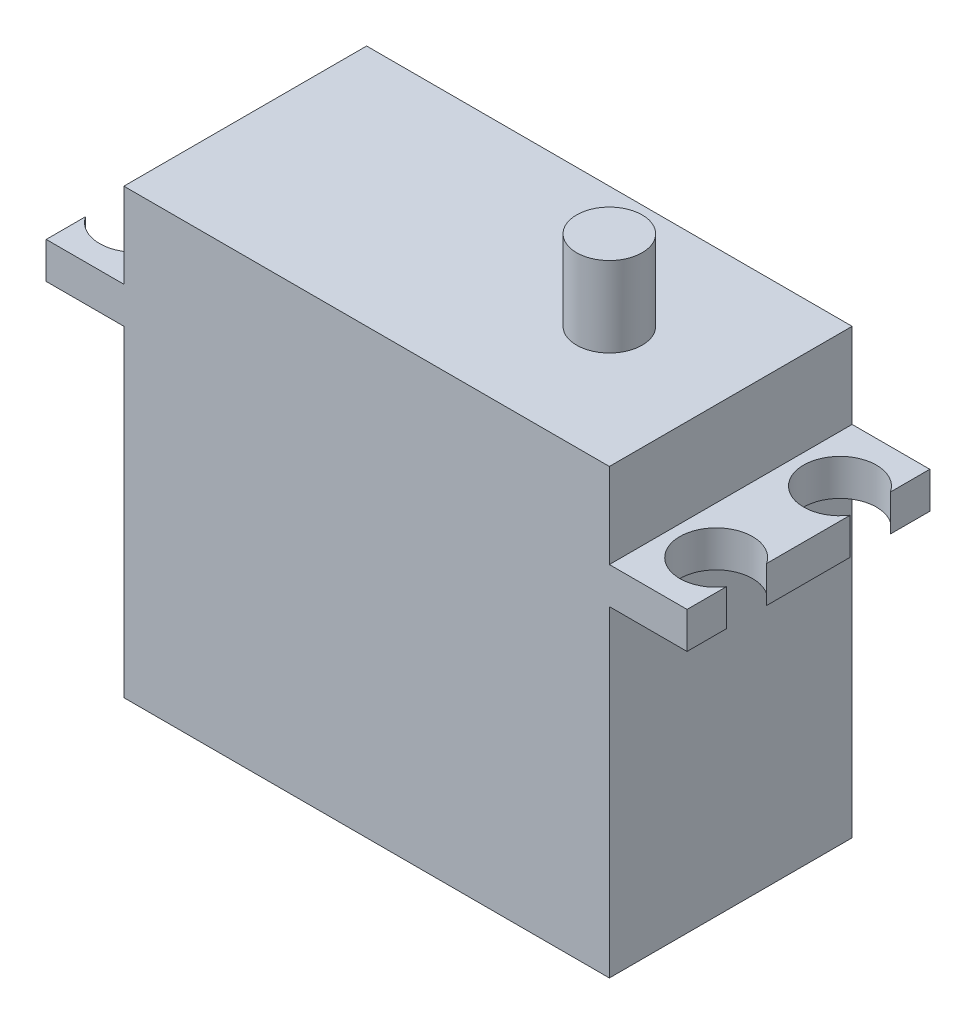
ISO-10303-21;
HEADER;
FILE_DESCRIPTION(('STEP AP214'),'2;1');
FILE_NAME('part.step','',(''),(''),'','','');
FILE_SCHEMA(('AUTOMOTIVE_DESIGN { 1 0 10303 214 1 1 1 1 }'));
ENDSEC;
DATA;
#1=APPLICATION_CONTEXT('core data for automotive mechanical design processes');
#2=APPLICATION_PROTOCOL_DEFINITION('international standard','automotive_design',2000,#1);
#3=PRODUCT_CONTEXT('',#1,'mechanical');
#4=PRODUCT('Part','Part','',(#3));
#5=PRODUCT_RELATED_PRODUCT_CATEGORY('part','',(#4));
#6=PRODUCT_DEFINITION_FORMATION('','',#4);
#7=PRODUCT_DEFINITION_CONTEXT('part definition',#1,'design');
#8=PRODUCT_DEFINITION('design','',#6,#7);
#9=PRODUCT_DEFINITION_SHAPE('','',#8);
#10=(LENGTH_UNIT() NAMED_UNIT(*) SI_UNIT(.MILLI.,.METRE.));
#11=(NAMED_UNIT(*) PLANE_ANGLE_UNIT() SI_UNIT($,.RADIAN.));
#12=(NAMED_UNIT(*) SI_UNIT($,.STERADIAN.) SOLID_ANGLE_UNIT());
#13=UNCERTAINTY_MEASURE_WITH_UNIT(LENGTH_MEASURE(1.E-05),#10,'distance_accuracy_value','');
#14=(GEOMETRIC_REPRESENTATION_CONTEXT(3) GLOBAL_UNCERTAINTY_ASSIGNED_CONTEXT((#13)) GLOBAL_UNIT_ASSIGNED_CONTEXT((#10,
#11,#12)) REPRESENTATION_CONTEXT('',''));
#15=CARTESIAN_POINT('',(0.,0.,0.));
#16=DIRECTION('',(0.,0.,1.));
#17=DIRECTION('',(1.,0.,0.));
#18=AXIS2_PLACEMENT_3D('',#15,#16,#17);
#19=CARTESIAN_POINT('',(0.,0.,20.));
#20=DIRECTION('',(0.,-1.,0.));
#21=DIRECTION('',(0.,0.,-1.));
#22=AXIS2_PLACEMENT_3D('',#19,#20,#21);
#23=PLANE('',#22);
#24=DIRECTION('',(-1.,0.,0.));
#25=VECTOR('',#24,1.);
#26=CARTESIAN_POINT('',(0.,0.,0.));
#27=LINE('',#26,#25);
#28=CARTESIAN_POINT('',(40.,0.,0.));
#29=VERTEX_POINT('',#28);
#30=CARTESIAN_POINT('',(0.,0.,0.));
#31=VERTEX_POINT('',#30);
#32=EDGE_CURVE('E282',#29,#31,#27,.T.);
#33=ORIENTED_EDGE('',*,*,#32,.T.);
#34=DIRECTION('',(0.,0.,-1.));
#35=VECTOR('',#34,1.);
#36=CARTESIAN_POINT('',(0.,0.,20.));
#37=LINE('',#36,#35);
#38=CARTESIAN_POINT('',(0.,0.,20.));
#39=VERTEX_POINT('',#38);
#40=EDGE_CURVE('E285',#39,#31,#37,.T.);
#41=ORIENTED_EDGE('',*,*,#40,.F.);
#42=DIRECTION('',(-1.,0.,0.));
#43=VECTOR('',#42,1.);
#44=CARTESIAN_POINT('',(0.,0.,20.));
#45=LINE('',#44,#43);
#46=CARTESIAN_POINT('',(40.,0.,20.));
#47=VERTEX_POINT('',#46);
#48=EDGE_CURVE('E288',#47,#39,#45,.T.);
#49=ORIENTED_EDGE('',*,*,#48,.F.);
#50=DIRECTION('',(0.,0.,-1.));
#51=VECTOR('',#50,1.);
#52=CARTESIAN_POINT('',(40.,0.,20.));
#53=LINE('',#52,#51);
#54=EDGE_CURVE('E287',#47,#29,#53,.T.);
#55=ORIENTED_EDGE('',*,*,#54,.T.);
#56=EDGE_LOOP('',(#33,#41,#49,#55));
#57=FACE_BOUND('',#56,.T.);
#58=CARTESIAN_POINT('',(30.,0.,10.));
#59=DIRECTION('',(0.,-1.,0.));
#60=DIRECTION('',(0.,0.,-1.));
#61=AXIS2_PLACEMENT_3D('',#58,#59,#60);
#62=CIRCLE('',#61,2.7);
#63=CARTESIAN_POINT('',(30.,0.,7.3));
#64=VERTEX_POINT('',#63);
#65=EDGE_CURVE('E11',#64,#64,#62,.F.);
#66=ORIENTED_EDGE('',*,*,#65,.F.);
#67=EDGE_LOOP('',(#66));
#68=FACE_BOUND('',#67,.T.);
#69=ADVANCED_FACE('F33',(#57,#68),#23,.F.);
#70=CARTESIAN_POINT('',(46.4,-10.,20.));
#71=DIRECTION('',(-1.,0.,0.));
#72=DIRECTION('',(0.,0.,1.));
#73=AXIS2_PLACEMENT_3D('',#70,#71,#72);
#74=PLANE('',#73);
#75=DIRECTION('',(0.,0.,-1.));
#76=VECTOR('',#75,1.);
#77=CARTESIAN_POINT('',(46.4,-10.,20.));
#78=LINE('',#77,#76);
#79=CARTESIAN_POINT('',(46.4,-9.99999999999999,13.4416876048223));
#80=VERTEX_POINT('',#79);
#81=CARTESIAN_POINT('',(46.4,-10.,6.55831239517771));
#82=VERTEX_POINT('',#81);
#83=EDGE_CURVE('E183',#80,#82,#78,.T.);
#84=ORIENTED_EDGE('',*,*,#83,.T.);
#85=DIRECTION('',(0.,1.,0.));
#86=VECTOR('',#85,1.);
#87=CARTESIAN_POINT('',(46.4,-36.5,6.55831239517772));
#88=LINE('',#87,#86);
#89=CARTESIAN_POINT('',(46.4,-6.99999999999999,6.55831239517771));
#90=VERTEX_POINT('',#89);
#91=EDGE_CURVE('E170',#82,#90,#88,.T.);
#92=ORIENTED_EDGE('',*,*,#91,.T.);
#93=DIRECTION('',(0.,0.,-1.));
#94=VECTOR('',#93,1.);
#95=CARTESIAN_POINT('',(46.4,-7.,20.));
#96=LINE('',#95,#94);
#97=CARTESIAN_POINT('',(46.4,-7.,13.4416876048223));
#98=VERTEX_POINT('',#97);
#99=EDGE_CURVE('E181',#98,#90,#96,.T.);
#100=ORIENTED_EDGE('',*,*,#99,.F.);
#101=DIRECTION('',(0.,1.,0.));
#102=VECTOR('',#101,1.);
#103=CARTESIAN_POINT('',(46.4,-36.5,13.4416876048223));
#104=LINE('',#103,#102);
#105=EDGE_CURVE('E56',#98,#80,#104,.F.);
#106=ORIENTED_EDGE('',*,*,#105,.T.);
#107=EDGE_LOOP('',(#84,#92,#100,#106));
#108=FACE_BOUND('',#107,.T.);
#109=ADVANCED_FACE('F180',(#108),#74,.F.);
#110=CARTESIAN_POINT('',(46.4,-10.,20.));
#111=VERTEX_POINT('',#110);
#112=CARTESIAN_POINT('',(46.4,-10.,16.7583123951777));
#113=VERTEX_POINT('',#112);
#114=EDGE_CURVE('E197',#111,#113,#78,.T.);
#115=ORIENTED_EDGE('',*,*,#114,.T.);
#116=DIRECTION('',(0.,1.,0.));
#117=VECTOR('',#116,1.);
#118=CARTESIAN_POINT('',(46.4,-36.5,16.7583123951777));
#119=LINE('',#118,#117);
#120=CARTESIAN_POINT('',(46.4,-6.99999999999999,16.7583123951777));
#121=VERTEX_POINT('',#120);
#122=EDGE_CURVE('E373',#113,#121,#119,.T.);
#123=ORIENTED_EDGE('',*,*,#122,.T.);
#124=CARTESIAN_POINT('',(46.4,-7.,20.));
#125=VERTEX_POINT('',#124);
#126=EDGE_CURVE('E189',#125,#121,#96,.T.);
#127=ORIENTED_EDGE('',*,*,#126,.F.);
#128=DIRECTION('',(0.,1.,0.));
#129=VECTOR('',#128,1.);
#130=CARTESIAN_POINT('',(46.4,-10.,20.));
#131=LINE('',#130,#129);
#132=EDGE_CURVE('E332',#111,#125,#131,.T.);
#133=ORIENTED_EDGE('',*,*,#132,.F.);
#134=EDGE_LOOP('',(#115,#123,#127,#133));
#135=FACE_BOUND('',#134,.T.);
#136=ADVANCED_FACE('F372',(#135),#74,.F.);
#137=CARTESIAN_POINT('',(-6.4,-7.,20.));
#138=DIRECTION('',(1.,0.,0.));
#139=DIRECTION('',(0.,1.,0.));
#140=AXIS2_PLACEMENT_3D('',#137,#138,#139);
#141=PLANE('',#140);
#142=DIRECTION('',(0.,0.,-1.));
#143=VECTOR('',#142,1.);
#144=CARTESIAN_POINT('',(-6.4,-10.,20.));
#145=LINE('',#144,#143);
#146=CARTESIAN_POINT('',(-6.4,-10.,13.4416876048223));
#147=VERTEX_POINT('',#146);
#148=CARTESIAN_POINT('',(-6.4,-10.,6.5583123951777));
#149=VERTEX_POINT('',#148);
#150=EDGE_CURVE('E217',#147,#149,#145,.T.);
#151=ORIENTED_EDGE('',*,*,#150,.F.);
#152=DIRECTION('',(0.,1.,0.));
#153=VECTOR('',#152,1.);
#154=CARTESIAN_POINT('',(-6.40000000000001,-36.5,13.4416876048223));
#155=LINE('',#154,#153);
#156=CARTESIAN_POINT('',(-6.4,-7.,13.4416876048223));
#157=VERTEX_POINT('',#156);
#158=EDGE_CURVE('E240',#147,#157,#155,.T.);
#159=ORIENTED_EDGE('',*,*,#158,.T.);
#160=DIRECTION('',(0.,0.,-1.));
#161=VECTOR('',#160,1.);
#162=CARTESIAN_POINT('',(-6.4,-7.,20.));
#163=LINE('',#162,#161);
#164=CARTESIAN_POINT('',(-6.4,-7.,6.5583123951777));
#165=VERTEX_POINT('',#164);
#166=EDGE_CURVE('E222',#157,#165,#163,.T.);
#167=ORIENTED_EDGE('',*,*,#166,.T.);
#168=DIRECTION('',(0.,1.,0.));
#169=VECTOR('',#168,1.);
#170=CARTESIAN_POINT('',(-6.40000000000001,-36.5,6.55831239517768));
#171=LINE('',#170,#169);
#172=EDGE_CURVE('E243',#165,#149,#171,.F.);
#173=ORIENTED_EDGE('',*,*,#172,.T.);
#174=EDGE_LOOP('',(#151,#159,#167,#173));
#175=FACE_BOUND('',#174,.T.);
#176=ADVANCED_FACE('F239',(#175),#141,.F.);
#177=CARTESIAN_POINT('',(-6.4,-10.,3.2416876048223));
#178=VERTEX_POINT('',#177);
#179=CARTESIAN_POINT('',(-6.4,-10.,0.));
#180=VERTEX_POINT('',#179);
#181=EDGE_CURVE('E212',#178,#180,#145,.T.);
#182=ORIENTED_EDGE('',*,*,#181,.F.);
#183=DIRECTION('',(0.,1.,0.));
#184=VECTOR('',#183,1.);
#185=CARTESIAN_POINT('',(-6.40000000000001,-36.5,3.24168760482232));
#186=LINE('',#185,#184);
#187=CARTESIAN_POINT('',(-6.4,-7.,3.2416876048223));
#188=VERTEX_POINT('',#187);
#189=EDGE_CURVE('E318',#178,#188,#186,.T.);
#190=ORIENTED_EDGE('',*,*,#189,.T.);
#191=CARTESIAN_POINT('',(-6.4,-7.,0.));
#192=VERTEX_POINT('',#191);
#193=EDGE_CURVE('E216',#188,#192,#163,.T.);
#194=ORIENTED_EDGE('',*,*,#193,.T.);
#195=DIRECTION('',(0.,-1.,0.));
#196=VECTOR('',#195,1.);
#197=CARTESIAN_POINT('',(-6.4,-7.,0.));
#198=LINE('',#197,#196);
#199=EDGE_CURVE('E252',#192,#180,#198,.T.);
#200=ORIENTED_EDGE('',*,*,#199,.T.);
#201=EDGE_LOOP('',(#182,#190,#194,#200));
#202=FACE_BOUND('',#201,.T.);
#203=ADVANCED_FACE('F253',(#202),#141,.F.);
#204=CARTESIAN_POINT('',(0.,0.,20.));
#205=DIRECTION('',(1.,0.,0.));
#206=DIRECTION('',(0.,1.,0.));
#207=AXIS2_PLACEMENT_3D('',#204,#205,#206);
#208=PLANE('',#207);
#209=DIRECTION('',(0.,-1.,0.));
#210=VECTOR('',#209,1.);
#211=CARTESIAN_POINT('',(0.,0.,0.));
#212=LINE('',#211,#210);
#213=CARTESIAN_POINT('',(0.,-7.,0.));
#214=VERTEX_POINT('',#213);
#215=EDGE_CURVE('E305',#31,#214,#212,.T.);
#216=ORIENTED_EDGE('',*,*,#215,.T.);
#217=DIRECTION('',(0.,0.,-1.));
#218=VECTOR('',#217,1.);
#219=CARTESIAN_POINT('',(0.,-7.,20.));
#220=LINE('',#219,#218);
#221=CARTESIAN_POINT('',(0.,-7.,20.));
#222=VERTEX_POINT('',#221);
#223=EDGE_CURVE('E221',#222,#214,#220,.T.);
#224=ORIENTED_EDGE('',*,*,#223,.F.);
#225=DIRECTION('',(0.,-1.,0.));
#226=VECTOR('',#225,1.);
#227=CARTESIAN_POINT('',(0.,0.,20.));
#228=LINE('',#227,#226);
#229=EDGE_CURVE('E284',#39,#222,#228,.T.);
#230=ORIENTED_EDGE('',*,*,#229,.F.);
#231=ORIENTED_EDGE('',*,*,#40,.T.);
#232=EDGE_LOOP('',(#216,#224,#230,#231));
#233=FACE_BOUND('',#232,.T.);
#234=ADVANCED_FACE('F35',(#233),#208,.F.);
#235=CARTESIAN_POINT('',(0.,-7.,20.));
#236=DIRECTION('',(0.,-1.,0.));
#237=DIRECTION('',(1.,0.,0.));
#238=AXIS2_PLACEMENT_3D('',#235,#236,#237);
#239=PLANE('',#238);
#240=ORIENTED_EDGE('',*,*,#166,.F.);
#241=CARTESIAN_POINT('',(-3.89999999999999,-7.,15.1));
#242=DIRECTION('',(0.,1.,0.));
#243=DIRECTION('',(-1.,0.,0.));
#244=AXIS2_PLACEMENT_3D('',#241,#242,#243);
#245=CIRCLE('',#244,3.);
#246=CARTESIAN_POINT('',(-6.4,-7.,16.7583123951777));
#247=VERTEX_POINT('',#246);
#248=EDGE_CURVE('E374',#247,#157,#245,.T.);
#249=ORIENTED_EDGE('',*,*,#248,.F.);
#250=CARTESIAN_POINT('',(-6.4,-7.,20.));
#251=VERTEX_POINT('',#250);
#252=EDGE_CURVE('E218',#251,#247,#163,.T.);
#253=ORIENTED_EDGE('',*,*,#252,.F.);
#254=DIRECTION('',(-1.,0.,0.));
#255=VECTOR('',#254,1.);
#256=CARTESIAN_POINT('',(0.,-7.,20.));
#257=LINE('',#256,#255);
#258=EDGE_CURVE('E313',#222,#251,#257,.T.);
#259=ORIENTED_EDGE('',*,*,#258,.F.);
#260=ORIENTED_EDGE('',*,*,#223,.T.);
#261=DIRECTION('',(-1.,0.,0.));
#262=VECTOR('',#261,1.);
#263=CARTESIAN_POINT('',(0.,-7.,0.));
#264=LINE('',#263,#262);
#265=EDGE_CURVE('E257',#214,#192,#264,.T.);
#266=ORIENTED_EDGE('',*,*,#265,.T.);
#267=ORIENTED_EDGE('',*,*,#193,.F.);
#268=CARTESIAN_POINT('',(-3.9,-7.,4.9));
#269=DIRECTION('',(0.,1.,0.));
#270=DIRECTION('',(-1.,0.,0.));
#271=AXIS2_PLACEMENT_3D('',#268,#269,#270);
#272=CIRCLE('',#271,3.);
#273=EDGE_CURVE('E383',#165,#188,#272,.T.);
#274=ORIENTED_EDGE('',*,*,#273,.F.);
#275=EDGE_LOOP('',(#240,#249,#253,#259,#260,#266,#267,#274));
#276=FACE_BOUND('',#275,.T.);
#277=ADVANCED_FACE('F339',(#276),#239,.F.);
#278=ORIENTED_EDGE('',*,*,#252,.T.);
#279=DIRECTION('',(0.,1.,0.));
#280=VECTOR('',#279,1.);
#281=CARTESIAN_POINT('',(-6.40000000000001,-36.5,16.7583123951777));
#282=LINE('',#281,#280);
#283=CARTESIAN_POINT('',(-6.4,-10.,16.7583123951777));
#284=VERTEX_POINT('',#283);
#285=EDGE_CURVE('E347',#247,#284,#282,.F.);
#286=ORIENTED_EDGE('',*,*,#285,.T.);
#287=CARTESIAN_POINT('',(-6.4,-10.,20.));
#288=VERTEX_POINT('',#287);
#289=EDGE_CURVE('E213',#288,#284,#145,.T.);
#290=ORIENTED_EDGE('',*,*,#289,.F.);
#291=DIRECTION('',(0.,-1.,0.));
#292=VECTOR('',#291,1.);
#293=CARTESIAN_POINT('',(-6.4,-7.,20.));
#294=LINE('',#293,#292);
#295=EDGE_CURVE('E315',#251,#288,#294,.T.);
#296=ORIENTED_EDGE('',*,*,#295,.F.);
#297=EDGE_LOOP('',(#278,#286,#290,#296));
#298=FACE_BOUND('',#297,.T.);
#299=ADVANCED_FACE('F346',(#298),#141,.F.);
#300=CARTESIAN_POINT('',(-6.4,-10.,20.));
#301=DIRECTION('',(0.,1.,0.));
#302=DIRECTION('',(0.,0.,1.));
#303=AXIS2_PLACEMENT_3D('',#300,#301,#302);
#304=PLANE('',#303);
#305=ORIENTED_EDGE('',*,*,#289,.T.);
#306=CARTESIAN_POINT('',(-3.89999999999999,-10.,15.1));
#307=DIRECTION('',(0.,1.,0.));
#308=DIRECTION('',(0.,0.,1.));
#309=AXIS2_PLACEMENT_3D('',#306,#307,#308);
#310=CIRCLE('',#309,3.);
#311=EDGE_CURVE('E41',#284,#147,#310,.T.);
#312=ORIENTED_EDGE('',*,*,#311,.T.);
#313=ORIENTED_EDGE('',*,*,#150,.T.);
#314=CARTESIAN_POINT('',(-3.9,-10.,4.9));
#315=DIRECTION('',(0.,1.,0.));
#316=DIRECTION('',(0.,0.,1.));
#317=AXIS2_PLACEMENT_3D('',#314,#315,#316);
#318=CIRCLE('',#317,3.);
#319=EDGE_CURVE('E225',#149,#178,#318,.T.);
#320=ORIENTED_EDGE('',*,*,#319,.T.);
#321=ORIENTED_EDGE('',*,*,#181,.T.);
#322=DIRECTION('',(1.,0.,0.));
#323=VECTOR('',#322,1.);
#324=CARTESIAN_POINT('',(-6.4,-10.,0.));
#325=LINE('',#324,#323);
#326=CARTESIAN_POINT('',(0.,-10.,0.));
#327=VERTEX_POINT('',#326);
#328=EDGE_CURVE('E248',#180,#327,#325,.T.);
#329=ORIENTED_EDGE('',*,*,#328,.T.);
#330=DIRECTION('',(0.,0.,-1.));
#331=VECTOR('',#330,1.);
#332=CARTESIAN_POINT('',(0.,-10.,20.));
#333=LINE('',#332,#331);
#334=CARTESIAN_POINT('',(0.,-10.,20.));
#335=VERTEX_POINT('',#334);
#336=EDGE_CURVE('E209',#335,#327,#333,.T.);
#337=ORIENTED_EDGE('',*,*,#336,.F.);
#338=DIRECTION('',(1.,0.,0.));
#339=VECTOR('',#338,1.);
#340=CARTESIAN_POINT('',(-6.4,-10.,20.));
#341=LINE('',#340,#339);
#342=EDGE_CURVE('E322',#288,#335,#341,.T.);
#343=ORIENTED_EDGE('',*,*,#342,.F.);
#344=EDGE_LOOP('',(#305,#312,#313,#320,#321,#329,#337,#343));
#345=FACE_BOUND('',#344,.T.);
#346=ADVANCED_FACE('F230',(#345),#304,.F.);
#347=CARTESIAN_POINT('',(0.,-10.,20.));
#348=DIRECTION('',(1.,0.,0.));
#349=DIRECTION('',(0.,1.,0.));
#350=AXIS2_PLACEMENT_3D('',#347,#348,#349);
#351=PLANE('',#350);
#352=DIRECTION('',(0.,-1.,0.));
#353=VECTOR('',#352,1.);
#354=CARTESIAN_POINT('',(0.,-10.,0.));
#355=LINE('',#354,#353);
#356=CARTESIAN_POINT('',(0.,-36.5,0.));
#357=VERTEX_POINT('',#356);
#358=EDGE_CURVE('E263',#327,#357,#355,.T.);
#359=ORIENTED_EDGE('',*,*,#358,.T.);
#360=DIRECTION('',(0.,0.,-1.));
#361=VECTOR('',#360,1.);
#362=CARTESIAN_POINT('',(0.,-36.5,20.));
#363=LINE('',#362,#361);
#364=CARTESIAN_POINT('',(0.,-36.5,20.));
#365=VERTEX_POINT('',#364);
#366=EDGE_CURVE('E206',#365,#357,#363,.T.);
#367=ORIENTED_EDGE('',*,*,#366,.F.);
#368=DIRECTION('',(0.,-1.,0.));
#369=VECTOR('',#368,1.);
#370=CARTESIAN_POINT('',(0.,-10.,20.));
#371=LINE('',#370,#369);
#372=EDGE_CURVE('E324',#335,#365,#371,.T.);
#373=ORIENTED_EDGE('',*,*,#372,.F.);
#374=ORIENTED_EDGE('',*,*,#336,.T.);
#375=EDGE_LOOP('',(#359,#367,#373,#374));
#376=FACE_BOUND('',#375,.T.);
#377=ADVANCED_FACE('F351',(#376),#351,.F.);
#378=CARTESIAN_POINT('',(0.,-36.5,20.));
#379=DIRECTION('',(0.,1.,0.));
#380=DIRECTION('',(0.,0.,1.));
#381=AXIS2_PLACEMENT_3D('',#378,#379,#380);
#382=PLANE('',#381);
#383=DIRECTION('',(1.,0.,0.));
#384=VECTOR('',#383,1.);
#385=CARTESIAN_POINT('',(0.,-36.5,0.));
#386=LINE('',#385,#384);
#387=CARTESIAN_POINT('',(40.,-36.5,0.));
#388=VERTEX_POINT('',#387);
#389=EDGE_CURVE('E265',#357,#388,#386,.T.);
#390=ORIENTED_EDGE('',*,*,#389,.T.);
#391=DIRECTION('',(0.,0.,-1.));
#392=VECTOR('',#391,1.);
#393=CARTESIAN_POINT('',(40.,-36.5,20.));
#394=LINE('',#393,#392);
#395=CARTESIAN_POINT('',(40.,-36.5,20.));
#396=VERTEX_POINT('',#395);
#397=EDGE_CURVE('E203',#396,#388,#394,.T.);
#398=ORIENTED_EDGE('',*,*,#397,.F.);
#399=DIRECTION('',(1.,0.,0.));
#400=VECTOR('',#399,1.);
#401=CARTESIAN_POINT('',(0.,-36.5,20.));
#402=LINE('',#401,#400);
#403=EDGE_CURVE('E326',#365,#396,#402,.T.);
#404=ORIENTED_EDGE('',*,*,#403,.F.);
#405=ORIENTED_EDGE('',*,*,#366,.T.);
#406=EDGE_LOOP('',(#390,#398,#404,#405));
#407=FACE_BOUND('',#406,.T.);
#408=ADVANCED_FACE('F357',(#407),#382,.F.);
#409=CARTESIAN_POINT('',(40.,-10.,20.));
#410=DIRECTION('',(-1.,0.,0.));
#411=DIRECTION('',(0.,0.,1.));
#412=AXIS2_PLACEMENT_3D('',#409,#410,#411);
#413=PLANE('',#412);
#414=DIRECTION('',(0.,1.,0.));
#415=VECTOR('',#414,1.);
#416=CARTESIAN_POINT('',(40.,-10.,0.));
#417=LINE('',#416,#415);
#418=CARTESIAN_POINT('',(40.,-10.,0.));
#419=VERTEX_POINT('',#418);
#420=EDGE_CURVE('E270',#388,#419,#417,.T.);
#421=ORIENTED_EDGE('',*,*,#420,.T.);
#422=DIRECTION('',(0.,0.,-1.));
#423=VECTOR('',#422,1.);
#424=CARTESIAN_POINT('',(40.,-10.,20.));
#425=LINE('',#424,#423);
#426=CARTESIAN_POINT('',(40.,-10.,20.));
#427=VERTEX_POINT('',#426);
#428=EDGE_CURVE('E200',#427,#419,#425,.T.);
#429=ORIENTED_EDGE('',*,*,#428,.F.);
#430=DIRECTION('',(0.,1.,0.));
#431=VECTOR('',#430,1.);
#432=CARTESIAN_POINT('',(40.,-10.,20.));
#433=LINE('',#432,#431);
#434=EDGE_CURVE('E328',#396,#427,#433,.T.);
#435=ORIENTED_EDGE('',*,*,#434,.F.);
#436=ORIENTED_EDGE('',*,*,#397,.T.);
#437=EDGE_LOOP('',(#421,#429,#435,#436));
#438=FACE_BOUND('',#437,.T.);
#439=ADVANCED_FACE('F360',(#438),#413,.F.);
#440=CARTESIAN_POINT('',(40.,-10.,20.));
#441=DIRECTION('',(0.,1.,0.));
#442=DIRECTION('',(0.,0.,1.));
#443=AXIS2_PLACEMENT_3D('',#440,#441,#442);
#444=PLANE('',#443);
#445=CARTESIAN_POINT('',(46.4,-9.99999999999999,3.24168760482228));
#446=VERTEX_POINT('',#445);
#447=CARTESIAN_POINT('',(46.4,-10.,0.));
#448=VERTEX_POINT('',#447);
#449=EDGE_CURVE('E192',#446,#448,#78,.T.);
#450=ORIENTED_EDGE('',*,*,#449,.F.);
#451=CARTESIAN_POINT('',(43.9,-10.,4.9));
#452=DIRECTION('',(0.,1.,0.));
#453=DIRECTION('',(0.,0.,1.));
#454=AXIS2_PLACEMENT_3D('',#451,#452,#453);
#455=CIRCLE('',#454,3.00000000000001);
#456=EDGE_CURVE('E185',#446,#82,#455,.T.);
#457=ORIENTED_EDGE('',*,*,#456,.T.);
#458=ORIENTED_EDGE('',*,*,#83,.F.);
#459=CARTESIAN_POINT('',(43.9,-10.,15.1));
#460=DIRECTION('',(0.,1.,0.));
#461=DIRECTION('',(0.,0.,1.));
#462=AXIS2_PLACEMENT_3D('',#459,#460,#461);
#463=CIRCLE('',#462,2.99999999999999);
#464=EDGE_CURVE('E375',#80,#113,#463,.T.);
#465=ORIENTED_EDGE('',*,*,#464,.T.);
#466=ORIENTED_EDGE('',*,*,#114,.F.);
#467=DIRECTION('',(1.,0.,0.));
#468=VECTOR('',#467,1.);
#469=CARTESIAN_POINT('',(40.,-10.,20.));
#470=LINE('',#469,#468);
#471=EDGE_CURVE('E330',#427,#111,#470,.T.);
#472=ORIENTED_EDGE('',*,*,#471,.F.);
#473=ORIENTED_EDGE('',*,*,#428,.T.);
#474=DIRECTION('',(1.,0.,0.));
#475=VECTOR('',#474,1.);
#476=CARTESIAN_POINT('',(40.,-10.,0.));
#477=LINE('',#476,#475);
#478=EDGE_CURVE('E272',#419,#448,#477,.T.);
#479=ORIENTED_EDGE('',*,*,#478,.T.);
#480=EDGE_LOOP('',(#450,#457,#458,#465,#466,#472,#473,#479));
#481=FACE_BOUND('',#480,.T.);
#482=ADVANCED_FACE('F366',(#481),#444,.F.);
#483=CARTESIAN_POINT('',(46.4,-7.,3.24168760482229));
#484=VERTEX_POINT('',#483);
#485=CARTESIAN_POINT('',(46.4,-7.,0.));
#486=VERTEX_POINT('',#485);
#487=EDGE_CURVE('E190',#484,#486,#96,.T.);
#488=ORIENTED_EDGE('',*,*,#487,.F.);
#489=DIRECTION('',(0.,1.,0.));
#490=VECTOR('',#489,1.);
#491=CARTESIAN_POINT('',(46.4,-36.5,3.24168760482228));
#492=LINE('',#491,#490);
#493=EDGE_CURVE('E48',#484,#446,#492,.F.);
#494=ORIENTED_EDGE('',*,*,#493,.T.);
#495=ORIENTED_EDGE('',*,*,#449,.T.);
#496=DIRECTION('',(0.,1.,0.));
#497=VECTOR('',#496,1.);
#498=CARTESIAN_POINT('',(46.4,-10.,0.));
#499=LINE('',#498,#497);
#500=EDGE_CURVE('E275',#448,#486,#499,.T.);
#501=ORIENTED_EDGE('',*,*,#500,.T.);
#502=EDGE_LOOP('',(#488,#494,#495,#501));
#503=FACE_BOUND('',#502,.T.);
#504=ADVANCED_FACE('F404',(#503),#74,.F.);
#505=CARTESIAN_POINT('',(46.4,-7.,20.));
#506=DIRECTION('',(0.,-1.,0.));
#507=DIRECTION('',(0.,0.,-1.));
#508=AXIS2_PLACEMENT_3D('',#505,#506,#507);
#509=PLANE('',#508);
#510=ORIENTED_EDGE('',*,*,#99,.T.);
#511=CARTESIAN_POINT('',(43.9,-6.99999999999999,4.9));
#512=DIRECTION('',(0.,1.,0.));
#513=DIRECTION('',(1.,0.,0.));
#514=AXIS2_PLACEMENT_3D('',#511,#512,#513);
#515=CIRCLE('',#514,3.00000000000001);
#516=EDGE_CURVE('E167',#484,#90,#515,.T.);
#517=ORIENTED_EDGE('',*,*,#516,.F.);
#518=ORIENTED_EDGE('',*,*,#487,.T.);
#519=DIRECTION('',(-1.,0.,0.));
#520=VECTOR('',#519,1.);
#521=CARTESIAN_POINT('',(46.4,-7.,0.));
#522=LINE('',#521,#520);
#523=CARTESIAN_POINT('',(40.,-7.,0.));
#524=VERTEX_POINT('',#523);
#525=EDGE_CURVE('E278',#486,#524,#522,.T.);
#526=ORIENTED_EDGE('',*,*,#525,.T.);
#527=DIRECTION('',(0.,0.,-1.));
#528=VECTOR('',#527,1.);
#529=CARTESIAN_POINT('',(40.,-7.,20.));
#530=LINE('',#529,#528);
#531=CARTESIAN_POINT('',(40.,-7.,20.));
#532=VERTEX_POINT('',#531);
#533=EDGE_CURVE('E193',#532,#524,#530,.T.);
#534=ORIENTED_EDGE('',*,*,#533,.F.);
#535=DIRECTION('',(-1.,0.,0.));
#536=VECTOR('',#535,1.);
#537=CARTESIAN_POINT('',(46.4,-7.,20.));
#538=LINE('',#537,#536);
#539=EDGE_CURVE('E334',#125,#532,#538,.T.);
#540=ORIENTED_EDGE('',*,*,#539,.F.);
#541=ORIENTED_EDGE('',*,*,#126,.T.);
#542=CARTESIAN_POINT('',(43.9,-6.99999999999999,15.1));
#543=DIRECTION('',(0.,1.,0.));
#544=DIRECTION('',(1.,0.,0.));
#545=AXIS2_PLACEMENT_3D('',#542,#543,#544);
#546=CIRCLE('',#545,2.99999999999999);
#547=EDGE_CURVE('E184',#98,#121,#546,.T.);
#548=ORIENTED_EDGE('',*,*,#547,.F.);
#549=EDGE_LOOP('',(#510,#517,#518,#526,#534,#540,#541,#548));
#550=FACE_BOUND('',#549,.T.);
#551=ADVANCED_FACE('F187',(#550),#509,.F.);
#552=CARTESIAN_POINT('',(40.,0.,20.));
#553=DIRECTION('',(-1.,0.,0.));
#554=DIRECTION('',(0.,0.,1.));
#555=AXIS2_PLACEMENT_3D('',#552,#553,#554);
#556=PLANE('',#555);
#557=DIRECTION('',(0.,1.,0.));
#558=VECTOR('',#557,1.);
#559=CARTESIAN_POINT('',(40.,0.,0.));
#560=LINE('',#559,#558);
#561=EDGE_CURVE('E280',#524,#29,#560,.T.);
#562=ORIENTED_EDGE('',*,*,#561,.T.);
#563=ORIENTED_EDGE('',*,*,#54,.F.);
#564=DIRECTION('',(0.,1.,0.));
#565=VECTOR('',#564,1.);
#566=CARTESIAN_POINT('',(40.,0.,20.));
#567=LINE('',#566,#565);
#568=EDGE_CURVE('E300',#532,#47,#567,.T.);
#569=ORIENTED_EDGE('',*,*,#568,.F.);
#570=ORIENTED_EDGE('',*,*,#533,.T.);
#571=EDGE_LOOP('',(#562,#563,#569,#570));
#572=FACE_BOUND('',#571,.T.);
#573=ADVANCED_FACE('F299',(#572),#556,.F.);
#574=CARTESIAN_POINT('',(0.,0.,20.));
#575=DIRECTION('',(0.,0.,-1.));
#576=DIRECTION('',(-1.,0.,0.));
#577=AXIS2_PLACEMENT_3D('',#574,#575,#576);
#578=PLANE('',#577);
#579=ORIENTED_EDGE('',*,*,#229,.T.);
#580=ORIENTED_EDGE('',*,*,#258,.T.);
#581=ORIENTED_EDGE('',*,*,#295,.T.);
#582=ORIENTED_EDGE('',*,*,#342,.T.);
#583=ORIENTED_EDGE('',*,*,#372,.T.);
#584=ORIENTED_EDGE('',*,*,#403,.T.);
#585=ORIENTED_EDGE('',*,*,#434,.T.);
#586=ORIENTED_EDGE('',*,*,#471,.T.);
#587=ORIENTED_EDGE('',*,*,#132,.T.);
#588=ORIENTED_EDGE('',*,*,#539,.T.);
#589=ORIENTED_EDGE('',*,*,#568,.T.);
#590=ORIENTED_EDGE('',*,*,#48,.T.);
#591=EDGE_LOOP('',(#579,#580,#581,#582,#583,#584,#585,#586,#587,#588,#589,#590));
#592=FACE_BOUND('',#591,.T.);
#593=ADVANCED_FACE('F344',(#592),#578,.F.);
#594=CARTESIAN_POINT('',(0.,0.,0.));
#595=DIRECTION('',(0.,0.,-1.));
#596=DIRECTION('',(-1.,0.,0.));
#597=AXIS2_PLACEMENT_3D('',#594,#595,#596);
#598=PLANE('',#597);
#599=ORIENTED_EDGE('',*,*,#215,.F.);
#600=ORIENTED_EDGE('',*,*,#32,.F.);
#601=ORIENTED_EDGE('',*,*,#561,.F.);
#602=ORIENTED_EDGE('',*,*,#525,.F.);
#603=ORIENTED_EDGE('',*,*,#500,.F.);
#604=ORIENTED_EDGE('',*,*,#478,.F.);
#605=ORIENTED_EDGE('',*,*,#420,.F.);
#606=ORIENTED_EDGE('',*,*,#389,.F.);
#607=ORIENTED_EDGE('',*,*,#358,.F.);
#608=ORIENTED_EDGE('',*,*,#328,.F.);
#609=ORIENTED_EDGE('',*,*,#199,.F.);
#610=ORIENTED_EDGE('',*,*,#265,.F.);
#611=EDGE_LOOP('',(#599,#600,#601,#602,#603,#604,#605,#606,#607,#608,#609,#610));
#612=FACE_BOUND('',#611,.T.);
#613=ADVANCED_FACE('F261',(#612),#598,.T.);
#614=CARTESIAN_POINT('',(-3.89999999999999,-36.5,4.9));
#615=DIRECTION('',(0.,1.,0.));
#616=DIRECTION('',(-1.,0.,0.));
#617=AXIS2_PLACEMENT_3D('',#614,#615,#616);
#618=CYLINDRICAL_SURFACE('',#617,3.);
#619=ORIENTED_EDGE('',*,*,#319,.F.);
#620=ORIENTED_EDGE('',*,*,#172,.F.);
#621=ORIENTED_EDGE('',*,*,#273,.T.);
#622=ORIENTED_EDGE('',*,*,#189,.F.);
#623=EDGE_LOOP('',(#619,#620,#621,#622));
#624=FACE_BOUND('',#623,.T.);
#625=ADVANCED_FACE('F385',(#624),#618,.F.);
#626=CARTESIAN_POINT('',(-3.89999999999999,-36.5,15.1));
#627=DIRECTION('',(0.,1.,0.));
#628=DIRECTION('',(-1.,0.,0.));
#629=AXIS2_PLACEMENT_3D('',#626,#627,#628);
#630=CYLINDRICAL_SURFACE('',#629,3.);
#631=ORIENTED_EDGE('',*,*,#311,.F.);
#632=ORIENTED_EDGE('',*,*,#285,.F.);
#633=ORIENTED_EDGE('',*,*,#248,.T.);
#634=ORIENTED_EDGE('',*,*,#158,.F.);
#635=EDGE_LOOP('',(#631,#632,#633,#634));
#636=FACE_BOUND('',#635,.T.);
#637=ADVANCED_FACE('F386',(#636),#630,.F.);
#638=CARTESIAN_POINT('',(43.9,-36.5,15.1));
#639=DIRECTION('',(0.,1.,0.));
#640=DIRECTION('',(-1.,0.,0.));
#641=AXIS2_PLACEMENT_3D('',#638,#639,#640);
#642=CYLINDRICAL_SURFACE('',#641,2.99999999999999);
#643=ORIENTED_EDGE('',*,*,#464,.F.);
#644=ORIENTED_EDGE('',*,*,#105,.F.);
#645=ORIENTED_EDGE('',*,*,#547,.T.);
#646=ORIENTED_EDGE('',*,*,#122,.F.);
#647=EDGE_LOOP('',(#643,#644,#645,#646));
#648=FACE_BOUND('',#647,.T.);
#649=ADVANCED_FACE('F388',(#648),#642,.F.);
#650=CARTESIAN_POINT('',(43.9,-36.5,4.9));
#651=DIRECTION('',(0.,1.,0.));
#652=DIRECTION('',(-1.,0.,0.));
#653=AXIS2_PLACEMENT_3D('',#650,#651,#652);
#654=CYLINDRICAL_SURFACE('',#653,3.00000000000001);
#655=ORIENTED_EDGE('',*,*,#456,.F.);
#656=ORIENTED_EDGE('',*,*,#493,.F.);
#657=ORIENTED_EDGE('',*,*,#516,.T.);
#658=ORIENTED_EDGE('',*,*,#91,.F.);
#659=EDGE_LOOP('',(#655,#656,#657,#658));
#660=FACE_BOUND('',#659,.T.);
#661=ADVANCED_FACE('F169',(#660),#654,.F.);
#662=CARTESIAN_POINT('',(30.,6.6,10.));
#663=DIRECTION('',(0.,-1.,0.));
#664=DIRECTION('',(0.,0.,-1.));
#665=AXIS2_PLACEMENT_3D('',#662,#663,#664);
#666=CYLINDRICAL_SURFACE('',#665,2.7);
#667=CARTESIAN_POINT('',(30.,6.6,10.));
#668=DIRECTION('',(0.,1.,0.));
#669=DIRECTION('',(0.,0.,1.));
#670=AXIS2_PLACEMENT_3D('',#667,#668,#669);
#671=CIRCLE('',#670,2.7);
#672=CARTESIAN_POINT('',(30.,6.6,12.7));
#673=VERTEX_POINT('',#672);
#674=EDGE_CURVE('E175',#673,#673,#671,.T.);
#675=ORIENTED_EDGE('',*,*,#674,.F.);
#676=EDGE_LOOP('',(#675));
#677=FACE_BOUND('',#676,.T.);
#678=ORIENTED_EDGE('',*,*,#65,.T.);
#679=EDGE_LOOP('',(#678));
#680=FACE_BOUND('',#679,.T.);
#681=ADVANCED_FACE('F539',(#677,#680),#666,.T.);
#682=CARTESIAN_POINT('',(30.,6.6,10.));
#683=DIRECTION('',(0.,1.,0.));
#684=DIRECTION('',(0.,0.,1.));
#685=AXIS2_PLACEMENT_3D('',#682,#683,#684);
#686=PLANE('',#685);
#687=ORIENTED_EDGE('',*,*,#674,.T.);
#688=EDGE_LOOP('',(#687));
#689=FACE_BOUND('',#688,.T.);
#690=ADVANCED_FACE('F547',(#689),#686,.T.);
#691=CLOSED_SHELL('',(#69,#109,#136,#176,#203,#234,#277,#299,#346,#377,#408,#439,#482,#504,#551,
#573,#593,#613,#625,#637,#649,#661,#681,#690));
#692=MANIFOLD_SOLID_BREP('B2',#691);
#693=ADVANCED_BREP_SHAPE_REPRESENTATION('',(#18,#692),#14);
#694=SHAPE_DEFINITION_REPRESENTATION(#9,#693);
ENDSEC;
END-ISO-10303-21;
